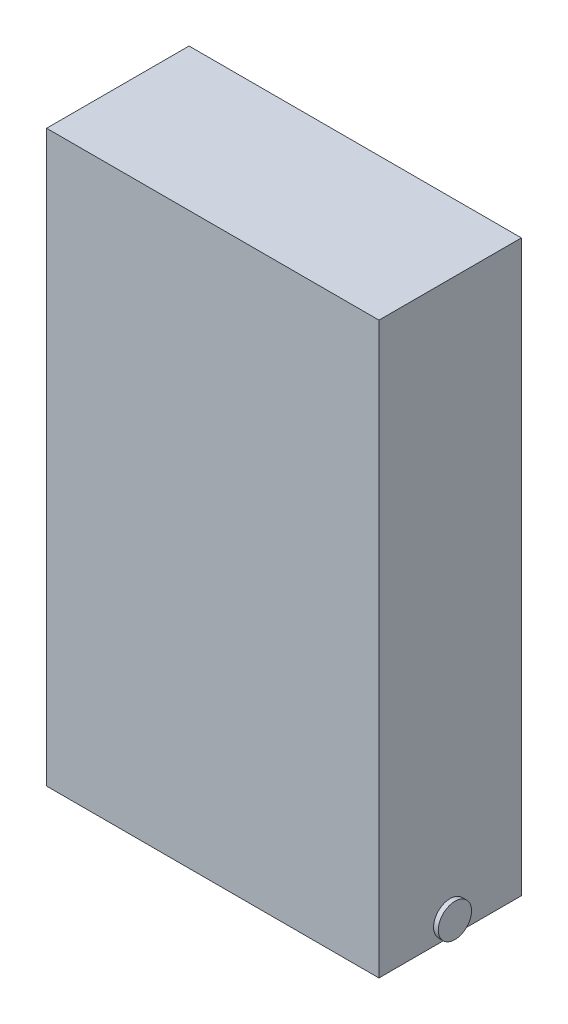
ISO-10303-21;
HEADER;
FILE_DESCRIPTION(('STEP AP214'),'2;1');
FILE_NAME('part.step','',(''),(''),'','','');
FILE_SCHEMA(('AUTOMOTIVE_DESIGN { 1 0 10303 214 1 1 1 1 }'));
ENDSEC;
DATA;
#1=APPLICATION_CONTEXT('core data for automotive mechanical design processes');
#2=APPLICATION_PROTOCOL_DEFINITION('international standard','automotive_design',2000,#1);
#3=PRODUCT_CONTEXT('',#1,'mechanical');
#4=PRODUCT('Part','Part','',(#3));
#5=PRODUCT_RELATED_PRODUCT_CATEGORY('part','',(#4));
#6=PRODUCT_DEFINITION_FORMATION('','',#4);
#7=PRODUCT_DEFINITION_CONTEXT('part definition',#1,'design');
#8=PRODUCT_DEFINITION('design','',#6,#7);
#9=PRODUCT_DEFINITION_SHAPE('','',#8);
#10=(LENGTH_UNIT() NAMED_UNIT(*) SI_UNIT(.MILLI.,.METRE.));
#11=(NAMED_UNIT(*) PLANE_ANGLE_UNIT() SI_UNIT($,.RADIAN.));
#12=(NAMED_UNIT(*) SI_UNIT($,.STERADIAN.) SOLID_ANGLE_UNIT());
#13=UNCERTAINTY_MEASURE_WITH_UNIT(LENGTH_MEASURE(1.E-05),#10,'distance_accuracy_value','');
#14=(GEOMETRIC_REPRESENTATION_CONTEXT(3) GLOBAL_UNCERTAINTY_ASSIGNED_CONTEXT((#13)) GLOBAL_UNIT_ASSIGNED_CONTEXT((#10,
#11,#12)) REPRESENTATION_CONTEXT('',''));
#15=CARTESIAN_POINT('',(0.,0.,0.));
#16=DIRECTION('',(0.,0.,1.));
#17=DIRECTION('',(1.,0.,0.));
#18=AXIS2_PLACEMENT_3D('',#15,#16,#17);
#19=CARTESIAN_POINT('',(0.,0.,150.));
#20=DIRECTION('',(1.,0.,0.));
#21=DIRECTION('',(0.,1.,0.));
#22=AXIS2_PLACEMENT_3D('',#19,#20,#21);
#23=PLANE('',#22);
#24=DIRECTION('',(0.,0.,-1.));
#25=VECTOR('',#24,1.);
#26=CARTESIAN_POINT('',(0.,0.,150.));
#27=LINE('',#26,#25);
#28=CARTESIAN_POINT('',(0.,0.,75.));
#29=VERTEX_POINT('',#28);
#30=CARTESIAN_POINT('',(0.,0.,0.));
#31=VERTEX_POINT('',#30);
#32=EDGE_CURVE('E50',#29,#31,#27,.T.);
#33=ORIENTED_EDGE('',*,*,#32,.F.);
#34=CARTESIAN_POINT('',(0.,17.5,75.));
#35=DIRECTION('',(1.,0.,0.));
#36=DIRECTION('',(0.,1.,0.));
#37=AXIS2_PLACEMENT_3D('',#34,#35,#36);
#38=CIRCLE('',#37,17.5);
#39=EDGE_CURVE('E55',#29,#29,#38,.T.);
#40=ORIENTED_EDGE('',*,*,#39,.T.);
#41=CARTESIAN_POINT('',(0.,0.,150.));
#42=VERTEX_POINT('',#41);
#43=EDGE_CURVE('E11',#42,#29,#27,.T.);
#44=ORIENTED_EDGE('',*,*,#43,.F.);
#45=DIRECTION('',(0.,-1.,0.));
#46=VECTOR('',#45,1.);
#47=CARTESIAN_POINT('',(0.,0.,150.));
#48=LINE('',#47,#46);
#49=CARTESIAN_POINT('',(-1.11022302462516E-13,600.,150.));
#50=VERTEX_POINT('',#49);
#51=EDGE_CURVE('E145',#50,#42,#48,.T.);
#52=ORIENTED_EDGE('',*,*,#51,.F.);
#53=DIRECTION('',(0.,0.,-1.));
#54=VECTOR('',#53,1.);
#55=CARTESIAN_POINT('',(-1.11022302462516E-13,600.,150.));
#56=LINE('',#55,#54);
#57=CARTESIAN_POINT('',(-1.11022302462516E-13,600.,0.));
#58=VERTEX_POINT('',#57);
#59=EDGE_CURVE('E138',#50,#58,#56,.T.);
#60=ORIENTED_EDGE('',*,*,#59,.T.);
#61=DIRECTION('',(0.,-1.,0.));
#62=VECTOR('',#61,1.);
#63=CARTESIAN_POINT('',(0.,0.,0.));
#64=LINE('',#63,#62);
#65=EDGE_CURVE('E151',#58,#31,#64,.T.);
#66=ORIENTED_EDGE('',*,*,#65,.T.);
#67=EDGE_LOOP('',(#33,#40,#44,#52,#60,#66));
#68=FACE_BOUND('',#67,.T.);
#69=ADVANCED_FACE('F42',(#68),#23,.F.);
#70=CARTESIAN_POINT('',(0.,0.,150.));
#71=DIRECTION('',(0.,1.,0.));
#72=DIRECTION('',(0.,0.,1.));
#73=AXIS2_PLACEMENT_3D('',#70,#71,#72);
#74=PLANE('',#73);
#75=DIRECTION('',(1.,0.,0.));
#76=VECTOR('',#75,1.);
#77=CARTESIAN_POINT('',(0.,0.,0.));
#78=LINE('',#77,#76);
#79=CARTESIAN_POINT('',(350.,0.,0.));
#80=VERTEX_POINT('',#79);
#81=EDGE_CURVE('E133',#31,#80,#78,.T.);
#82=ORIENTED_EDGE('',*,*,#81,.T.);
#83=DIRECTION('',(0.,0.,-1.));
#84=VECTOR('',#83,1.);
#85=CARTESIAN_POINT('',(350.,0.,150.));
#86=LINE('',#85,#84);
#87=CARTESIAN_POINT('',(350.,0.,75.));
#88=VERTEX_POINT('',#87);
#89=EDGE_CURVE('E129',#88,#80,#86,.T.);
#90=ORIENTED_EDGE('',*,*,#89,.F.);
#91=CARTESIAN_POINT('',(350.,0.,150.));
#92=VERTEX_POINT('',#91);
#93=EDGE_CURVE('E121',#92,#88,#86,.T.);
#94=ORIENTED_EDGE('',*,*,#93,.F.);
#95=DIRECTION('',(1.,0.,0.));
#96=VECTOR('',#95,1.);
#97=CARTESIAN_POINT('',(0.,0.,150.));
#98=LINE('',#97,#96);
#99=EDGE_CURVE('E91',#42,#92,#98,.T.);
#100=ORIENTED_EDGE('',*,*,#99,.F.);
#101=ORIENTED_EDGE('',*,*,#43,.T.);
#102=ORIENTED_EDGE('',*,*,#32,.T.);
#103=EDGE_LOOP('',(#82,#90,#94,#100,#101,#102));
#104=FACE_BOUND('',#103,.T.);
#105=ADVANCED_FACE('F131',(#104),#74,.F.);
#106=CARTESIAN_POINT('',(350.,0.,150.));
#107=DIRECTION('',(-1.,0.,0.));
#108=DIRECTION('',(0.,-1.,0.));
#109=AXIS2_PLACEMENT_3D('',#106,#107,#108);
#110=PLANE('',#109);
#111=ORIENTED_EDGE('',*,*,#93,.T.);
#112=CARTESIAN_POINT('',(350.,17.5,75.));
#113=DIRECTION('',(1.,0.,0.));
#114=DIRECTION('',(0.,1.,0.));
#115=AXIS2_PLACEMENT_3D('',#112,#113,#114);
#116=CIRCLE('',#115,17.5);
#117=EDGE_CURVE('E125',#88,#88,#116,.T.);
#118=ORIENTED_EDGE('',*,*,#117,.F.);
#119=ORIENTED_EDGE('',*,*,#89,.T.);
#120=DIRECTION('',(0.,1.,0.));
#121=VECTOR('',#120,1.);
#122=CARTESIAN_POINT('',(350.,0.,0.));
#123=LINE('',#122,#121);
#124=CARTESIAN_POINT('',(350.,600.,0.));
#125=VERTEX_POINT('',#124);
#126=EDGE_CURVE('E146',#80,#125,#123,.T.);
#127=ORIENTED_EDGE('',*,*,#126,.T.);
#128=DIRECTION('',(0.,0.,-1.));
#129=VECTOR('',#128,1.);
#130=CARTESIAN_POINT('',(350.,600.,150.));
#131=LINE('',#130,#129);
#132=CARTESIAN_POINT('',(350.,600.,150.));
#133=VERTEX_POINT('',#132);
#134=EDGE_CURVE('E136',#133,#125,#131,.T.);
#135=ORIENTED_EDGE('',*,*,#134,.F.);
#136=DIRECTION('',(0.,1.,0.));
#137=VECTOR('',#136,1.);
#138=CARTESIAN_POINT('',(350.,0.,150.));
#139=LINE('',#138,#137);
#140=EDGE_CURVE('E127',#92,#133,#139,.T.);
#141=ORIENTED_EDGE('',*,*,#140,.F.);
#142=EDGE_LOOP('',(#111,#118,#119,#127,#135,#141));
#143=FACE_BOUND('',#142,.T.);
#144=ADVANCED_FACE('F123',(#143),#110,.F.);
#145=CARTESIAN_POINT('',(-1.11022302462516E-13,600.,150.));
#146=DIRECTION('',(0.,-1.,0.));
#147=DIRECTION('',(0.,0.,-1.));
#148=AXIS2_PLACEMENT_3D('',#145,#146,#147);
#149=PLANE('',#148);
#150=DIRECTION('',(-1.,0.,0.));
#151=VECTOR('',#150,1.);
#152=CARTESIAN_POINT('',(-1.11022302462516E-13,600.,0.));
#153=LINE('',#152,#151);
#154=EDGE_CURVE('E84',#125,#58,#153,.T.);
#155=ORIENTED_EDGE('',*,*,#154,.T.);
#156=ORIENTED_EDGE('',*,*,#59,.F.);
#157=DIRECTION('',(-1.,0.,0.));
#158=VECTOR('',#157,1.);
#159=CARTESIAN_POINT('',(-1.11022302462516E-13,600.,150.));
#160=LINE('',#159,#158);
#161=EDGE_CURVE('E63',#133,#50,#160,.T.);
#162=ORIENTED_EDGE('',*,*,#161,.F.);
#163=ORIENTED_EDGE('',*,*,#134,.T.);
#164=EDGE_LOOP('',(#155,#156,#162,#163));
#165=FACE_BOUND('',#164,.T.);
#166=ADVANCED_FACE('F242',(#165),#149,.F.);
#167=CARTESIAN_POINT('',(0.,0.,150.));
#168=DIRECTION('',(0.,0.,-1.));
#169=DIRECTION('',(-1.,0.,0.));
#170=AXIS2_PLACEMENT_3D('',#167,#168,#169);
#171=PLANE('',#170);
#172=ORIENTED_EDGE('',*,*,#51,.T.);
#173=ORIENTED_EDGE('',*,*,#99,.T.);
#174=ORIENTED_EDGE('',*,*,#140,.T.);
#175=ORIENTED_EDGE('',*,*,#161,.T.);
#176=EDGE_LOOP('',(#172,#173,#174,#175));
#177=FACE_BOUND('',#176,.T.);
#178=ADVANCED_FACE('F241',(#177),#171,.F.);
#179=CARTESIAN_POINT('',(0.,0.,0.));
#180=DIRECTION('',(0.,0.,-1.));
#181=DIRECTION('',(-1.,0.,0.));
#182=AXIS2_PLACEMENT_3D('',#179,#180,#181);
#183=PLANE('',#182);
#184=ORIENTED_EDGE('',*,*,#65,.F.);
#185=ORIENTED_EDGE('',*,*,#154,.F.);
#186=ORIENTED_EDGE('',*,*,#126,.F.);
#187=ORIENTED_EDGE('',*,*,#81,.F.);
#188=EDGE_LOOP('',(#184,#185,#186,#187));
#189=FACE_BOUND('',#188,.T.);
#190=ADVANCED_FACE('F249',(#189),#183,.T.);
#191=CARTESIAN_POINT('',(355.,17.5,75.));
#192=DIRECTION('',(-1.,0.,0.));
#193=DIRECTION('',(0.,-1.,0.));
#194=AXIS2_PLACEMENT_3D('',#191,#192,#193);
#195=CYLINDRICAL_SURFACE('',#194,17.5);
#196=CARTESIAN_POINT('',(355.,17.5,75.));
#197=DIRECTION('',(1.,0.,0.));
#198=DIRECTION('',(0.,1.,0.));
#199=AXIS2_PLACEMENT_3D('',#196,#197,#198);
#200=CIRCLE('',#199,17.5);
#201=CARTESIAN_POINT('',(355.,35.,75.));
#202=VERTEX_POINT('',#201);
#203=EDGE_CURVE('E193',#202,#202,#200,.T.);
#204=ORIENTED_EDGE('',*,*,#203,.F.);
#205=EDGE_LOOP('',(#204));
#206=FACE_BOUND('',#205,.T.);
#207=ORIENTED_EDGE('',*,*,#117,.T.);
#208=EDGE_LOOP('',(#207));
#209=FACE_BOUND('',#208,.T.);
#210=ADVANCED_FACE('F254',(#206,#209),#195,.T.);
#211=CARTESIAN_POINT('',(355.,17.5,75.));
#212=DIRECTION('',(1.,0.,0.));
#213=DIRECTION('',(0.,1.,0.));
#214=AXIS2_PLACEMENT_3D('',#211,#212,#213);
#215=PLANE('',#214);
#216=ORIENTED_EDGE('',*,*,#203,.T.);
#217=EDGE_LOOP('',(#216));
#218=FACE_BOUND('',#217,.T.);
#219=ADVANCED_FACE('F229',(#218),#215,.T.);
#220=CARTESIAN_POINT('',(-5.,17.5,75.));
#221=DIRECTION('',(1.,0.,0.));
#222=DIRECTION('',(0.,1.,0.));
#223=AXIS2_PLACEMENT_3D('',#220,#221,#222);
#224=CYLINDRICAL_SURFACE('',#223,17.5);
#225=CARTESIAN_POINT('',(-5.,17.5,75.));
#226=DIRECTION('',(1.,0.,0.));
#227=DIRECTION('',(0.,1.,0.));
#228=AXIS2_PLACEMENT_3D('',#225,#226,#227);
#229=CIRCLE('',#228,17.5);
#230=CARTESIAN_POINT('',(-5.,35.,75.));
#231=VERTEX_POINT('',#230);
#232=EDGE_CURVE('E210',#231,#231,#229,.T.);
#233=ORIENTED_EDGE('',*,*,#232,.T.);
#234=EDGE_LOOP('',(#233));
#235=FACE_BOUND('',#234,.T.);
#236=ORIENTED_EDGE('',*,*,#39,.F.);
#237=EDGE_LOOP('',(#236));
#238=FACE_BOUND('',#237,.T.);
#239=ADVANCED_FACE('F220',(#235,#238),#224,.T.);
#240=CARTESIAN_POINT('',(-5.,17.5,75.));
#241=DIRECTION('',(-1.,0.,0.));
#242=DIRECTION('',(0.,1.,0.));
#243=AXIS2_PLACEMENT_3D('',#240,#241,#242);
#244=PLANE('',#243);
#245=ORIENTED_EDGE('',*,*,#232,.F.);
#246=EDGE_LOOP('',(#245));
#247=FACE_BOUND('',#246,.T.);
#248=ADVANCED_FACE('F222',(#247),#244,.T.);
#249=CLOSED_SHELL('',(#69,#105,#144,#166,#178,#190,#210,#219,#239,#248));
#250=CARTESIAN_POINT('',(24.9999999999999,25.,102.5));
#251=DIRECTION('',(-1.,0.,0.));
#252=DIRECTION('',(0.,0.,1.));
#253=AXIS2_PLACEMENT_3D('',#250,#251,#252);
#254=PLANE('',#253);
#255=DIRECTION('',(0.,1.,0.));
#256=VECTOR('',#255,1.);
#257=CARTESIAN_POINT('',(24.9999999999999,25.,2.5));
#258=LINE('',#257,#256);
#259=CARTESIAN_POINT('',(24.9999999999999,25.,2.5));
#260=VERTEX_POINT('',#259);
#261=CARTESIAN_POINT('',(24.9999999999999,275.,2.5));
#262=VERTEX_POINT('',#261);
#263=EDGE_CURVE('E189',#260,#262,#258,.T.);
#264=ORIENTED_EDGE('',*,*,#263,.T.);
#265=DIRECTION('',(0.,0.,-1.));
#266=VECTOR('',#265,1.);
#267=CARTESIAN_POINT('',(24.9999999999999,275.,102.5));
#268=LINE('',#267,#266);
#269=CARTESIAN_POINT('',(24.9999999999999,275.,102.5));
#270=VERTEX_POINT('',#269);
#271=EDGE_CURVE('E164',#270,#262,#268,.T.);
#272=ORIENTED_EDGE('',*,*,#271,.F.);
#273=DIRECTION('',(0.,1.,0.));
#274=VECTOR('',#273,1.);
#275=CARTESIAN_POINT('',(24.9999999999999,25.,102.5));
#276=LINE('',#275,#274);
#277=CARTESIAN_POINT('',(24.9999999999999,25.,102.5));
#278=VERTEX_POINT('',#277);
#279=EDGE_CURVE('E180',#278,#270,#276,.T.);
#280=ORIENTED_EDGE('',*,*,#279,.F.);
#281=DIRECTION('',(0.,0.,-1.));
#282=VECTOR('',#281,1.);
#283=CARTESIAN_POINT('',(24.9999999999999,25.,102.5));
#284=LINE('',#283,#282);
#285=EDGE_CURVE('E155',#278,#260,#284,.T.);
#286=ORIENTED_EDGE('',*,*,#285,.T.);
#287=EDGE_LOOP('',(#264,#272,#280,#286));
#288=FACE_BOUND('',#287,.T.);
#289=ADVANCED_FACE('F257',(#288),#254,.F.);
#290=CARTESIAN_POINT('',(24.9999999999999,25.,102.5));
#291=DIRECTION('',(0.,-1.,0.));
#292=DIRECTION('',(1.,0.,0.));
#293=AXIS2_PLACEMENT_3D('',#290,#291,#292);
#294=PLANE('',#293);
#295=DIRECTION('',(-1.,0.,0.));
#296=VECTOR('',#295,1.);
#297=CARTESIAN_POINT('',(24.9999999999999,25.,2.5));
#298=LINE('',#297,#296);
#299=CARTESIAN_POINT('',(325.,25.,2.5));
#300=VERTEX_POINT('',#299);
#301=EDGE_CURVE('E176',#300,#260,#298,.T.);
#302=ORIENTED_EDGE('',*,*,#301,.T.);
#303=ORIENTED_EDGE('',*,*,#285,.F.);
#304=DIRECTION('',(-1.,0.,0.));
#305=VECTOR('',#304,1.);
#306=CARTESIAN_POINT('',(24.9999999999999,25.,102.5));
#307=LINE('',#306,#305);
#308=CARTESIAN_POINT('',(325.,25.,102.5));
#309=VERTEX_POINT('',#308);
#310=EDGE_CURVE('E168',#309,#278,#307,.T.);
#311=ORIENTED_EDGE('',*,*,#310,.F.);
#312=DIRECTION('',(0.,0.,-1.));
#313=VECTOR('',#312,1.);
#314=CARTESIAN_POINT('',(325.,25.,102.5));
#315=LINE('',#314,#313);
#316=EDGE_CURVE('E171',#309,#300,#315,.T.);
#317=ORIENTED_EDGE('',*,*,#316,.T.);
#318=EDGE_LOOP('',(#302,#303,#311,#317));
#319=FACE_BOUND('',#318,.T.);
#320=ADVANCED_FACE('F259',(#319),#294,.F.);
#321=CARTESIAN_POINT('',(325.,25.,102.5));
#322=DIRECTION('',(1.,0.,0.));
#323=DIRECTION('',(0.,0.,-1.));
#324=AXIS2_PLACEMENT_3D('',#321,#322,#323);
#325=PLANE('',#324);
#326=DIRECTION('',(0.,-1.,0.));
#327=VECTOR('',#326,1.);
#328=CARTESIAN_POINT('',(325.,25.,2.5));
#329=LINE('',#328,#327);
#330=CARTESIAN_POINT('',(325.,275.,2.5));
#331=VERTEX_POINT('',#330);
#332=EDGE_CURVE('E181',#331,#300,#329,.T.);
#333=ORIENTED_EDGE('',*,*,#332,.T.);
#334=ORIENTED_EDGE('',*,*,#316,.F.);
#335=DIRECTION('',(0.,-1.,0.));
#336=VECTOR('',#335,1.);
#337=CARTESIAN_POINT('',(325.,25.,102.5));
#338=LINE('',#337,#336);
#339=CARTESIAN_POINT('',(325.,275.,102.5));
#340=VERTEX_POINT('',#339);
#341=EDGE_CURVE('E197',#340,#309,#338,.T.);
#342=ORIENTED_EDGE('',*,*,#341,.F.);
#343=DIRECTION('',(0.,0.,-1.));
#344=VECTOR('',#343,1.);
#345=CARTESIAN_POINT('',(325.,275.,102.5));
#346=LINE('',#345,#344);
#347=EDGE_CURVE('E167',#340,#331,#346,.T.);
#348=ORIENTED_EDGE('',*,*,#347,.T.);
#349=EDGE_LOOP('',(#333,#334,#342,#348));
#350=FACE_BOUND('',#349,.T.);
#351=ADVANCED_FACE('F266',(#350),#325,.F.);
#352=CARTESIAN_POINT('',(24.9999999999999,275.,102.5));
#353=DIRECTION('',(0.,1.,0.));
#354=DIRECTION('',(-1.,0.,0.));
#355=AXIS2_PLACEMENT_3D('',#352,#353,#354);
#356=PLANE('',#355);
#357=DIRECTION('',(1.,0.,0.));
#358=VECTOR('',#357,1.);
#359=CARTESIAN_POINT('',(24.9999999999999,275.,2.5));
#360=LINE('',#359,#358);
#361=EDGE_CURVE('E185',#262,#331,#360,.T.);
#362=ORIENTED_EDGE('',*,*,#361,.T.);
#363=ORIENTED_EDGE('',*,*,#347,.F.);
#364=DIRECTION('',(1.,0.,0.));
#365=VECTOR('',#364,1.);
#366=CARTESIAN_POINT('',(24.9999999999999,275.,102.5));
#367=LINE('',#366,#365);
#368=EDGE_CURVE('E201',#270,#340,#367,.T.);
#369=ORIENTED_EDGE('',*,*,#368,.F.);
#370=ORIENTED_EDGE('',*,*,#271,.T.);
#371=EDGE_LOOP('',(#362,#363,#369,#370));
#372=FACE_BOUND('',#371,.T.);
#373=ADVANCED_FACE('F262',(#372),#356,.F.);
#374=CARTESIAN_POINT('',(0.,0.,102.5));
#375=DIRECTION('',(0.,0.,-1.));
#376=DIRECTION('',(-1.,0.,0.));
#377=AXIS2_PLACEMENT_3D('',#374,#375,#376);
#378=PLANE('',#377);
#379=ORIENTED_EDGE('',*,*,#279,.T.);
#380=ORIENTED_EDGE('',*,*,#368,.T.);
#381=ORIENTED_EDGE('',*,*,#341,.T.);
#382=ORIENTED_EDGE('',*,*,#310,.T.);
#383=EDGE_LOOP('',(#379,#380,#381,#382));
#384=FACE_BOUND('',#383,.T.);
#385=ADVANCED_FACE('F265',(#384),#378,.T.);
#386=CARTESIAN_POINT('',(0.,0.,2.5));
#387=DIRECTION('',(0.,0.,-1.));
#388=DIRECTION('',(-1.,0.,0.));
#389=AXIS2_PLACEMENT_3D('',#386,#387,#388);
#390=PLANE('',#389);
#391=ORIENTED_EDGE('',*,*,#263,.F.);
#392=ORIENTED_EDGE('',*,*,#301,.F.);
#393=ORIENTED_EDGE('',*,*,#332,.F.);
#394=ORIENTED_EDGE('',*,*,#361,.F.);
#395=EDGE_LOOP('',(#391,#392,#393,#394));
#396=FACE_BOUND('',#395,.T.);
#397=ADVANCED_FACE('F274',(#396),#390,.F.);
#398=CLOSED_SHELL('',(#289,#320,#351,#373,#385,#397));
#399=ORIENTED_CLOSED_SHELL('',*,#398,.T.);
#400=BREP_WITH_VOIDS('B2',#249,(#399));
#401=ADVANCED_BREP_SHAPE_REPRESENTATION('',(#18,#400),#14);
#402=SHAPE_DEFINITION_REPRESENTATION(#9,#401);
ENDSEC;
END-ISO-10303-21;
